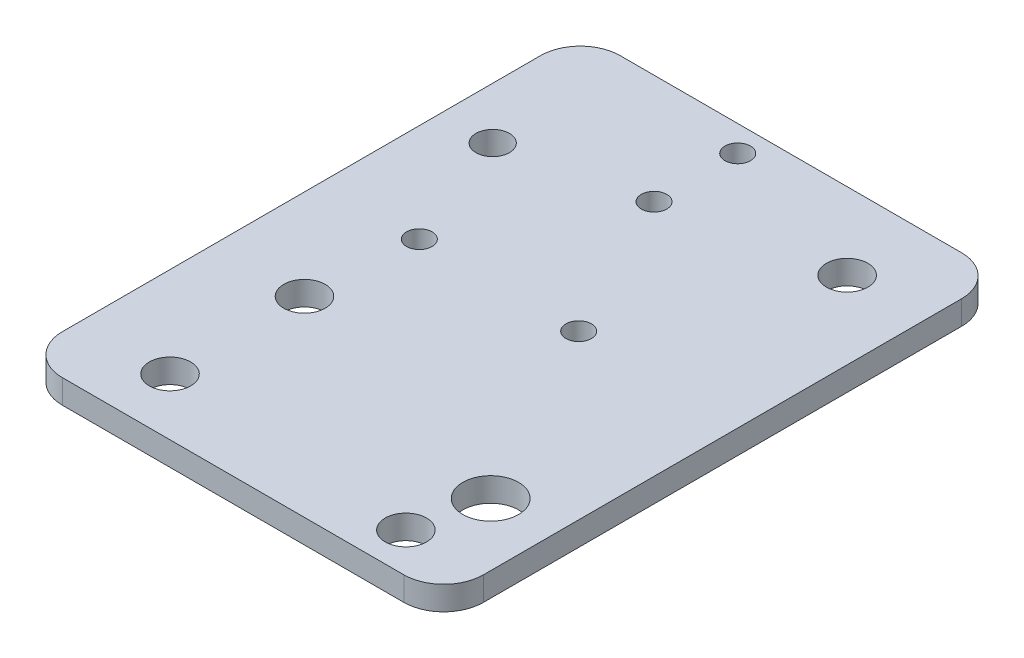
ISO-10303-21;
HEADER;
FILE_DESCRIPTION(('STEP AP214'),'2;1');
FILE_NAME('part.step','',(''),(''),'','','');
FILE_SCHEMA(('AUTOMOTIVE_DESIGN { 1 0 10303 214 1 1 1 1 }'));
ENDSEC;
DATA;
#1=APPLICATION_CONTEXT('core data for automotive mechanical design processes');
#2=APPLICATION_PROTOCOL_DEFINITION('international standard','automotive_design',2000,#1);
#3=PRODUCT_CONTEXT('',#1,'mechanical');
#4=PRODUCT('Part','Part','',(#3));
#5=PRODUCT_RELATED_PRODUCT_CATEGORY('part','',(#4));
#6=PRODUCT_DEFINITION_FORMATION('','',#4);
#7=PRODUCT_DEFINITION_CONTEXT('part definition',#1,'design');
#8=PRODUCT_DEFINITION('design','',#6,#7);
#9=PRODUCT_DEFINITION_SHAPE('','',#8);
#10=(LENGTH_UNIT() NAMED_UNIT(*) SI_UNIT(.MILLI.,.METRE.));
#11=(NAMED_UNIT(*) PLANE_ANGLE_UNIT() SI_UNIT($,.RADIAN.));
#12=(NAMED_UNIT(*) SI_UNIT($,.STERADIAN.) SOLID_ANGLE_UNIT());
#13=UNCERTAINTY_MEASURE_WITH_UNIT(LENGTH_MEASURE(1.E-05),#10,'distance_accuracy_value','');
#14=(GEOMETRIC_REPRESENTATION_CONTEXT(3) GLOBAL_UNCERTAINTY_ASSIGNED_CONTEXT((#13)) GLOBAL_UNIT_ASSIGNED_CONTEXT((#10,
#11,#12)) REPRESENTATION_CONTEXT('',''));
#15=CARTESIAN_POINT('',(0.,0.,0.));
#16=DIRECTION('',(0.,0.,1.));
#17=DIRECTION('',(1.,0.,0.));
#18=AXIS2_PLACEMENT_3D('',#15,#16,#17);
#19=CARTESIAN_POINT('',(0.,3.,0.));
#20=DIRECTION('',(0.,-1.,0.));
#21=DIRECTION('',(0.,0.,-1.));
#22=AXIS2_PLACEMENT_3D('',#19,#20,#21);
#23=PLANE('',#22);
#24=CARTESIAN_POINT('',(-55.1536510286206,3.,27.8419924035995));
#25=DIRECTION('',(0.,-1.,0.));
#26=DIRECTION('',(0.,0.,-1.));
#27=AXIS2_PLACEMENT_3D('',#24,#25,#26);
#28=CIRCLE('',#27,2.6);
#29=CARTESIAN_POINT('',(-55.1536510286206,3.,25.2419924035995));
#30=VERTEX_POINT('',#29);
#31=EDGE_CURVE('E217',#30,#30,#28,.T.);
#32=ORIENTED_EDGE('',*,*,#31,.T.);
#33=EDGE_LOOP('',(#32));
#34=FACE_BOUND('',#33,.T.);
#35=CARTESIAN_POINT('',(-34.1536511490396,3.,-2.44805253618551));
#36=DIRECTION('',(0.,-1.,0.));
#37=DIRECTION('',(0.,0.,-1.));
#38=AXIS2_PLACEMENT_3D('',#35,#36,#37);
#39=CIRCLE('',#38,1.6);
#40=CARTESIAN_POINT('',(-34.1536511490396,3.,-4.04805253618551));
#41=VERTEX_POINT('',#40);
#42=EDGE_CURVE('E206',#41,#41,#39,.T.);
#43=ORIENTED_EDGE('',*,*,#42,.T.);
#44=EDGE_LOOP('',(#43));
#45=FACE_BOUND('',#44,.T.);
#46=CARTESIAN_POINT('',(-55.1536510286206,3.,10.9673620704614));
#47=DIRECTION('',(0.,-1.,0.));
#48=DIRECTION('',(0.,0.,-1.));
#49=AXIS2_PLACEMENT_3D('',#46,#47,#48);
#50=CIRCLE('',#49,2.6);
#51=CARTESIAN_POINT('',(-55.1536510286206,3.,8.36736207046137));
#52=VERTEX_POINT('',#51);
#53=EDGE_CURVE('E205',#52,#52,#50,.T.);
#54=ORIENTED_EDGE('',*,*,#53,.T.);
#55=EDGE_LOOP('',(#54));
#56=FACE_BOUND('',#55,.T.);
#57=CARTESIAN_POINT('',(-23.3936511490355,3.,-25.3762360884705));
#58=DIRECTION('',(0.,-1.,0.));
#59=DIRECTION('',(0.,0.,-1.));
#60=AXIS2_PLACEMENT_3D('',#57,#58,#59);
#61=CIRCLE('',#60,2.6);
#62=CARTESIAN_POINT('',(-23.3936511490355,3.,-27.9762360884705));
#63=VERTEX_POINT('',#62);
#64=EDGE_CURVE('E199',#63,#63,#61,.T.);
#65=ORIENTED_EDGE('',*,*,#64,.T.);
#66=EDGE_LOOP('',(#65));
#67=FACE_BOUND('',#66,.T.);
#68=CARTESIAN_POINT('',(-54.1536511490395,3.,-2.44805253618551));
#69=DIRECTION('',(0.,-1.,0.));
#70=DIRECTION('',(0.,0.,-1.));
#71=AXIS2_PLACEMENT_3D('',#68,#69,#70);
#72=CIRCLE('',#71,1.6);
#73=CARTESIAN_POINT('',(-54.1536511490395,3.,-4.04805253618551));
#74=VERTEX_POINT('',#73);
#75=EDGE_CURVE('E218',#74,#74,#72,.T.);
#76=ORIENTED_EDGE('',*,*,#75,.T.);
#77=EDGE_LOOP('',(#76));
#78=FACE_BOUND('',#77,.T.);
#79=CARTESIAN_POINT('',(-23.3936511491627,3.,30.0000000000001));
#80=DIRECTION('',(0.,-1.,0.));
#81=DIRECTION('',(0.,0.,-1.));
#82=AXIS2_PLACEMENT_3D('',#79,#80,#81);
#83=CIRCLE('',#82,2.6);
#84=CARTESIAN_POINT('',(-23.3936511491627,3.,27.4000000000001));
#85=VERTEX_POINT('',#84);
#86=EDGE_CURVE('E194',#85,#85,#83,.T.);
#87=ORIENTED_EDGE('',*,*,#86,.T.);
#88=EDGE_LOOP('',(#87));
#89=FACE_BOUND('',#88,.T.);
#90=CARTESIAN_POINT('',(-43.5000000000002,3.,-21.25));
#91=DIRECTION('',(0.,-1.,0.));
#92=DIRECTION('',(0.,0.,1.));
#93=AXIS2_PLACEMENT_3D('',#90,#91,#92);
#94=CIRCLE('',#93,1.6);
#95=CARTESIAN_POINT('',(-43.5000000000002,3.,-19.65));
#96=VERTEX_POINT('',#95);
#97=EDGE_CURVE('E177',#96,#96,#94,.T.);
#98=ORIENTED_EDGE('',*,*,#97,.T.);
#99=EDGE_LOOP('',(#98));
#100=FACE_BOUND('',#99,.T.);
#101=CARTESIAN_POINT('',(-21.5000000000002,3.,21.25));
#102=DIRECTION('',(0.,-1.,0.));
#103=DIRECTION('',(0.,0.,-1.));
#104=AXIS2_PLACEMENT_3D('',#101,#102,#103);
#105=CIRCLE('',#104,3.5);
#106=CARTESIAN_POINT('',(-21.5000000000002,3.,17.75));
#107=VERTEX_POINT('',#106);
#108=EDGE_CURVE('E186',#107,#107,#105,.T.);
#109=ORIENTED_EDGE('',*,*,#108,.T.);
#110=EDGE_LOOP('',(#109));
#111=FACE_BOUND('',#110,.T.);
#112=CARTESIAN_POINT('',(-43.5000000000002,3.,-31.75));
#113=DIRECTION('',(0.,-1.,0.));
#114=DIRECTION('',(0.,0.,-1.));
#115=AXIS2_PLACEMENT_3D('',#112,#113,#114);
#116=CIRCLE('',#115,1.60000000000001);
#117=CARTESIAN_POINT('',(-43.5000000000002,3.,-33.35));
#118=VERTEX_POINT('',#117);
#119=EDGE_CURVE('E181',#118,#118,#116,.T.);
#120=ORIENTED_EDGE('',*,*,#119,.T.);
#121=EDGE_LOOP('',(#120));
#122=FACE_BOUND('',#121,.T.);
#123=CARTESIAN_POINT('',(-60.,3.,-17.5000000000001));
#124=DIRECTION('',(0.,1.,0.));
#125=DIRECTION('',(0.,0.,1.));
#126=AXIS2_PLACEMENT_3D('',#123,#124,#125);
#127=CIRCLE('',#126,2.1);
#128=CARTESIAN_POINT('',(-60.,3.,-15.4000000000001));
#129=VERTEX_POINT('',#128);
#130=EDGE_CURVE('E174',#129,#129,#127,.T.);
#131=ORIENTED_EDGE('',*,*,#130,.F.);
#132=EDGE_LOOP('',(#131));
#133=FACE_BOUND('',#132,.T.);
#134=DIRECTION('',(0.,0.,1.));
#135=VECTOR('',#134,1.);
#136=CARTESIAN_POINT('',(-13.6536511490428,3.,-35.));
#137=LINE('',#136,#135);
#138=CARTESIAN_POINT('',(-13.6536511490428,3.,-30.));
#139=VERTEX_POINT('',#138);
#140=CARTESIAN_POINT('',(-13.6536511490428,3.,30.));
#141=VERTEX_POINT('',#140);
#142=EDGE_CURVE('E164',#139,#141,#137,.T.);
#143=ORIENTED_EDGE('',*,*,#142,.F.);
#144=CARTESIAN_POINT('',(-18.6536511490428,3.,-30.));
#145=DIRECTION('',(0.,-1.,0.));
#146=DIRECTION('',(0.,0.,-1.));
#147=AXIS2_PLACEMENT_3D('',#144,#145,#146);
#148=CIRCLE('',#147,5.);
#149=CARTESIAN_POINT('',(-18.6536511490428,3.,-35.));
#150=VERTEX_POINT('',#149);
#151=EDGE_CURVE('E151',#139,#150,#148,.F.);
#152=ORIENTED_EDGE('',*,*,#151,.T.);
#153=DIRECTION('',(-1.,0.,0.));
#154=VECTOR('',#153,1.);
#155=CARTESIAN_POINT('',(-17.5,3.,-35.));
#156=LINE('',#155,#154);
#157=CARTESIAN_POINT('',(-61.5,3.,-35.));
#158=VERTEX_POINT('',#157);
#159=EDGE_CURVE('E129',#150,#158,#156,.T.);
#160=ORIENTED_EDGE('',*,*,#159,.T.);
#161=CARTESIAN_POINT('',(-61.5,3.,-30.));
#162=DIRECTION('',(0.,-1.,0.));
#163=DIRECTION('',(0.,0.,-1.));
#164=AXIS2_PLACEMENT_3D('',#161,#162,#163);
#165=CIRCLE('',#164,5.);
#166=CARTESIAN_POINT('',(-66.5,3.,-30.));
#167=VERTEX_POINT('',#166);
#168=EDGE_CURVE('E124',#158,#167,#165,.F.);
#169=ORIENTED_EDGE('',*,*,#168,.T.);
#170=DIRECTION('',(0.,0.,1.));
#171=VECTOR('',#170,1.);
#172=CARTESIAN_POINT('',(-66.5,3.,35.));
#173=LINE('',#172,#171);
#174=CARTESIAN_POINT('',(-66.5,3.,30.));
#175=VERTEX_POINT('',#174);
#176=EDGE_CURVE('E170',#167,#175,#173,.T.);
#177=ORIENTED_EDGE('',*,*,#176,.T.);
#178=CARTESIAN_POINT('',(-61.5,3.,30.));
#179=DIRECTION('',(0.,-1.,0.));
#180=DIRECTION('',(0.,0.,-1.));
#181=AXIS2_PLACEMENT_3D('',#178,#179,#180);
#182=CIRCLE('',#181,5.);
#183=CARTESIAN_POINT('',(-61.5,3.,35.));
#184=VERTEX_POINT('',#183);
#185=EDGE_CURVE('E119',#175,#184,#182,.F.);
#186=ORIENTED_EDGE('',*,*,#185,.T.);
#187=DIRECTION('',(1.,0.,0.));
#188=VECTOR('',#187,1.);
#189=CARTESIAN_POINT('',(-17.5,3.,35.));
#190=LINE('',#189,#188);
#191=CARTESIAN_POINT('',(-18.6536511490428,3.,35.));
#192=VERTEX_POINT('',#191);
#193=EDGE_CURVE('E125',#184,#192,#190,.T.);
#194=ORIENTED_EDGE('',*,*,#193,.T.);
#195=CARTESIAN_POINT('',(-18.6536511490428,3.,30.));
#196=DIRECTION('',(0.,-1.,0.));
#197=DIRECTION('',(0.,0.,-1.));
#198=AXIS2_PLACEMENT_3D('',#195,#196,#197);
#199=CIRCLE('',#198,5.);
#200=EDGE_CURVE('E149',#192,#141,#199,.F.);
#201=ORIENTED_EDGE('',*,*,#200,.T.);
#202=EDGE_LOOP('',(#143,#152,#160,#169,#177,#186,#194,#201));
#203=FACE_BOUND('',#202,.T.);
#204=ADVANCED_FACE('F36',(#34,#45,#56,#67,#78,#89,#100,#111,#122,#133,#203),#23,.F.);
#205=CARTESIAN_POINT('',(0.,0.,0.));
#206=DIRECTION('',(0.,-1.,0.));
#207=DIRECTION('',(0.,0.,-1.));
#208=AXIS2_PLACEMENT_3D('',#205,#206,#207);
#209=PLANE('',#208);
#210=CARTESIAN_POINT('',(-55.1536510286206,0.,27.8419924035995));
#211=DIRECTION('',(0.,-1.,0.));
#212=DIRECTION('',(0.,0.,-1.));
#213=AXIS2_PLACEMENT_3D('',#210,#211,#212);
#214=CIRCLE('',#213,2.6);
#215=CARTESIAN_POINT('',(-55.1536510286206,0.,25.2419924035995));
#216=VERTEX_POINT('',#215);
#217=EDGE_CURVE('E214',#216,#216,#214,.T.);
#218=ORIENTED_EDGE('',*,*,#217,.F.);
#219=EDGE_LOOP('',(#218));
#220=FACE_BOUND('',#219,.T.);
#221=CARTESIAN_POINT('',(-34.1536511490396,0.,-2.44805253618551));
#222=DIRECTION('',(0.,-1.,0.));
#223=DIRECTION('',(0.,0.,-1.));
#224=AXIS2_PLACEMENT_3D('',#221,#222,#223);
#225=CIRCLE('',#224,1.6);
#226=CARTESIAN_POINT('',(-34.1536511490396,0.,-4.04805253618551));
#227=VERTEX_POINT('',#226);
#228=EDGE_CURVE('E221',#227,#227,#225,.T.);
#229=ORIENTED_EDGE('',*,*,#228,.F.);
#230=EDGE_LOOP('',(#229));
#231=FACE_BOUND('',#230,.T.);
#232=CARTESIAN_POINT('',(-55.1536510286206,0.,10.9673620704614));
#233=DIRECTION('',(0.,-1.,0.));
#234=DIRECTION('',(0.,0.,-1.));
#235=AXIS2_PLACEMENT_3D('',#232,#233,#234);
#236=CIRCLE('',#235,2.6);
#237=CARTESIAN_POINT('',(-55.1536510286206,0.,8.36736207046137));
#238=VERTEX_POINT('',#237);
#239=EDGE_CURVE('E202',#238,#238,#236,.T.);
#240=ORIENTED_EDGE('',*,*,#239,.F.);
#241=EDGE_LOOP('',(#240));
#242=FACE_BOUND('',#241,.T.);
#243=CARTESIAN_POINT('',(-23.3936511490355,0.,-25.3762360884705));
#244=DIRECTION('',(0.,-1.,0.));
#245=DIRECTION('',(0.,0.,-1.));
#246=AXIS2_PLACEMENT_3D('',#243,#244,#245);
#247=CIRCLE('',#246,2.6);
#248=CARTESIAN_POINT('',(-23.3936511490355,0.,-27.9762360884705));
#249=VERTEX_POINT('',#248);
#250=EDGE_CURVE('E209',#249,#249,#247,.T.);
#251=ORIENTED_EDGE('',*,*,#250,.F.);
#252=EDGE_LOOP('',(#251));
#253=FACE_BOUND('',#252,.T.);
#254=CARTESIAN_POINT('',(-54.1536511490395,0.,-2.44805253618551));
#255=DIRECTION('',(0.,-1.,0.));
#256=DIRECTION('',(0.,0.,-1.));
#257=AXIS2_PLACEMENT_3D('',#254,#255,#256);
#258=CIRCLE('',#257,1.6);
#259=CARTESIAN_POINT('',(-54.1536511490395,0.,-4.04805253618551));
#260=VERTEX_POINT('',#259);
#261=EDGE_CURVE('E226',#260,#260,#258,.T.);
#262=ORIENTED_EDGE('',*,*,#261,.F.);
#263=EDGE_LOOP('',(#262));
#264=FACE_BOUND('',#263,.T.);
#265=CARTESIAN_POINT('',(-23.3936511491627,0.,30.0000000000001));
#266=DIRECTION('',(0.,-1.,0.));
#267=DIRECTION('',(0.,0.,-1.));
#268=AXIS2_PLACEMENT_3D('',#265,#266,#267);
#269=CIRCLE('',#268,2.6);
#270=CARTESIAN_POINT('',(-23.3936511491627,0.,27.4000000000001));
#271=VERTEX_POINT('',#270);
#272=EDGE_CURVE('E196',#271,#271,#269,.T.);
#273=ORIENTED_EDGE('',*,*,#272,.F.);
#274=EDGE_LOOP('',(#273));
#275=FACE_BOUND('',#274,.T.);
#276=DIRECTION('',(-1.,0.,0.));
#277=VECTOR('',#276,1.);
#278=CARTESIAN_POINT('',(-17.5,0.,-35.));
#279=LINE('',#278,#277);
#280=CARTESIAN_POINT('',(-18.6536511490428,0.,-35.));
#281=VERTEX_POINT('',#280);
#282=CARTESIAN_POINT('',(-61.5,0.,-35.));
#283=VERTEX_POINT('',#282);
#284=EDGE_CURVE('E102',#281,#283,#279,.T.);
#285=ORIENTED_EDGE('',*,*,#284,.F.);
#286=CARTESIAN_POINT('',(-18.6536511490428,0.,-30.));
#287=DIRECTION('',(0.,-1.,0.));
#288=DIRECTION('',(0.,0.,-1.));
#289=AXIS2_PLACEMENT_3D('',#286,#287,#288);
#290=CIRCLE('',#289,5.);
#291=CARTESIAN_POINT('',(-13.6536511490428,0.,-30.));
#292=VERTEX_POINT('',#291);
#293=EDGE_CURVE('E44',#281,#292,#290,.T.);
#294=ORIENTED_EDGE('',*,*,#293,.T.);
#295=DIRECTION('',(0.,0.,1.));
#296=VECTOR('',#295,1.);
#297=CARTESIAN_POINT('',(-13.6536511490428,0.,-35.));
#298=LINE('',#297,#296);
#299=CARTESIAN_POINT('',(-13.6536511490428,0.,30.));
#300=VERTEX_POINT('',#299);
#301=EDGE_CURVE('E155',#292,#300,#298,.T.);
#302=ORIENTED_EDGE('',*,*,#301,.T.);
#303=CARTESIAN_POINT('',(-18.6536511490428,0.,30.));
#304=DIRECTION('',(0.,-1.,0.));
#305=DIRECTION('',(0.,0.,-1.));
#306=AXIS2_PLACEMENT_3D('',#303,#304,#305);
#307=CIRCLE('',#306,5.);
#308=CARTESIAN_POINT('',(-18.6536511490428,0.,35.));
#309=VERTEX_POINT('',#308);
#310=EDGE_CURVE('E51',#300,#309,#307,.T.);
#311=ORIENTED_EDGE('',*,*,#310,.T.);
#312=DIRECTION('',(1.,0.,0.));
#313=VECTOR('',#312,1.);
#314=CARTESIAN_POINT('',(-17.5,0.,35.));
#315=LINE('',#314,#313);
#316=CARTESIAN_POINT('',(-61.5,0.,35.));
#317=VERTEX_POINT('',#316);
#318=EDGE_CURVE('E108',#317,#309,#315,.T.);
#319=ORIENTED_EDGE('',*,*,#318,.F.);
#320=CARTESIAN_POINT('',(-61.5,0.,30.));
#321=DIRECTION('',(0.,-1.,0.));
#322=DIRECTION('',(0.,0.,-1.));
#323=AXIS2_PLACEMENT_3D('',#320,#321,#322);
#324=CIRCLE('',#323,5.);
#325=CARTESIAN_POINT('',(-66.5,0.,30.));
#326=VERTEX_POINT('',#325);
#327=EDGE_CURVE('E120',#317,#326,#324,.T.);
#328=ORIENTED_EDGE('',*,*,#327,.T.);
#329=DIRECTION('',(0.,0.,1.));
#330=VECTOR('',#329,1.);
#331=CARTESIAN_POINT('',(-66.5,0.,35.));
#332=LINE('',#331,#330);
#333=CARTESIAN_POINT('',(-66.5,0.,-30.));
#334=VERTEX_POINT('',#333);
#335=EDGE_CURVE('E109',#334,#326,#332,.T.);
#336=ORIENTED_EDGE('',*,*,#335,.F.);
#337=CARTESIAN_POINT('',(-61.5,0.,-30.));
#338=DIRECTION('',(0.,-1.,0.));
#339=DIRECTION('',(0.,0.,-1.));
#340=AXIS2_PLACEMENT_3D('',#337,#338,#339);
#341=CIRCLE('',#340,5.);
#342=EDGE_CURVE('E113',#334,#283,#341,.T.);
#343=ORIENTED_EDGE('',*,*,#342,.T.);
#344=EDGE_LOOP('',(#285,#294,#302,#311,#319,#328,#336,#343));
#345=FACE_BOUND('',#344,.T.);
#346=CARTESIAN_POINT('',(-43.5000000000002,0.,-21.25));
#347=DIRECTION('',(0.,-1.,0.));
#348=DIRECTION('',(0.,0.,1.));
#349=AXIS2_PLACEMENT_3D('',#346,#347,#348);
#350=CIRCLE('',#349,1.6);
#351=CARTESIAN_POINT('',(-43.5000000000002,0.,-19.65));
#352=VERTEX_POINT('',#351);
#353=EDGE_CURVE('E178',#352,#352,#350,.T.);
#354=ORIENTED_EDGE('',*,*,#353,.F.);
#355=EDGE_LOOP('',(#354));
#356=FACE_BOUND('',#355,.T.);
#357=CARTESIAN_POINT('',(-21.5000000000002,0.,21.25));
#358=DIRECTION('',(0.,-1.,0.));
#359=DIRECTION('',(0.,0.,-1.));
#360=AXIS2_PLACEMENT_3D('',#357,#358,#359);
#361=CIRCLE('',#360,3.5);
#362=CARTESIAN_POINT('',(-21.5000000000002,0.,17.75));
#363=VERTEX_POINT('',#362);
#364=EDGE_CURVE('E163',#363,#363,#361,.T.);
#365=ORIENTED_EDGE('',*,*,#364,.F.);
#366=EDGE_LOOP('',(#365));
#367=FACE_BOUND('',#366,.T.);
#368=CARTESIAN_POINT('',(-43.5000000000002,0.,-31.75));
#369=DIRECTION('',(0.,-1.,0.));
#370=DIRECTION('',(0.,0.,-1.));
#371=AXIS2_PLACEMENT_3D('',#368,#369,#370);
#372=CIRCLE('',#371,1.60000000000001);
#373=CARTESIAN_POINT('',(-43.5000000000002,0.,-33.35));
#374=VERTEX_POINT('',#373);
#375=EDGE_CURVE('E189',#374,#374,#372,.T.);
#376=ORIENTED_EDGE('',*,*,#375,.F.);
#377=EDGE_LOOP('',(#376));
#378=FACE_BOUND('',#377,.T.);
#379=CARTESIAN_POINT('',(-60.,0.,-17.5000000000001));
#380=DIRECTION('',(0.,-1.,0.));
#381=DIRECTION('',(0.,0.,-1.));
#382=AXIS2_PLACEMENT_3D('',#379,#380,#381);
#383=CIRCLE('',#382,2.1);
#384=CARTESIAN_POINT('',(-60.,0.,-19.6000000000001));
#385=VERTEX_POINT('',#384);
#386=EDGE_CURVE('E132',#385,#385,#383,.T.);
#387=ORIENTED_EDGE('',*,*,#386,.F.);
#388=EDGE_LOOP('',(#387));
#389=FACE_BOUND('',#388,.T.);
#390=ADVANCED_FACE('F114',(#220,#231,#242,#253,#264,#275,#345,#356,#367,#378,#389),#209,.T.);
#391=CARTESIAN_POINT('',(-17.5,3.,-35.));
#392=DIRECTION('',(0.,0.,1.));
#393=DIRECTION('',(1.,0.,0.));
#394=AXIS2_PLACEMENT_3D('',#391,#392,#393);
#395=PLANE('',#394);
#396=ORIENTED_EDGE('',*,*,#159,.F.);
#397=DIRECTION('',(0.,1.,0.));
#398=VECTOR('',#397,1.);
#399=CARTESIAN_POINT('',(-18.6536511490428,3.,-35.));
#400=LINE('',#399,#398);
#401=EDGE_CURVE('E59',#150,#281,#400,.F.);
#402=ORIENTED_EDGE('',*,*,#401,.T.);
#403=ORIENTED_EDGE('',*,*,#284,.T.);
#404=DIRECTION('',(0.,1.,0.));
#405=VECTOR('',#404,1.);
#406=CARTESIAN_POINT('',(-61.5,3.,-35.));
#407=LINE('',#406,#405);
#408=EDGE_CURVE('E106',#283,#158,#407,.T.);
#409=ORIENTED_EDGE('',*,*,#408,.T.);
#410=EDGE_LOOP('',(#396,#402,#403,#409));
#411=FACE_BOUND('',#410,.T.);
#412=ADVANCED_FACE('F104',(#411),#395,.F.);
#413=CARTESIAN_POINT('',(-17.5,3.,35.));
#414=DIRECTION('',(0.,0.,-1.));
#415=DIRECTION('',(-1.,0.,0.));
#416=AXIS2_PLACEMENT_3D('',#413,#414,#415);
#417=PLANE('',#416);
#418=ORIENTED_EDGE('',*,*,#318,.T.);
#419=DIRECTION('',(0.,1.,0.));
#420=VECTOR('',#419,1.);
#421=CARTESIAN_POINT('',(-18.6536511490428,3.,35.));
#422=LINE('',#421,#420);
#423=EDGE_CURVE('E11',#309,#192,#422,.T.);
#424=ORIENTED_EDGE('',*,*,#423,.T.);
#425=ORIENTED_EDGE('',*,*,#193,.F.);
#426=DIRECTION('',(0.,1.,0.));
#427=VECTOR('',#426,1.);
#428=CARTESIAN_POINT('',(-61.5,0.,35.));
#429=LINE('',#428,#427);
#430=EDGE_CURVE('E142',#184,#317,#429,.F.);
#431=ORIENTED_EDGE('',*,*,#430,.T.);
#432=EDGE_LOOP('',(#418,#424,#425,#431));
#433=FACE_BOUND('',#432,.T.);
#434=ADVANCED_FACE('F268',(#433),#417,.F.);
#435=CARTESIAN_POINT('',(-66.5,0.,35.));
#436=DIRECTION('',(-1.,0.,0.));
#437=DIRECTION('',(0.,0.,1.));
#438=AXIS2_PLACEMENT_3D('',#435,#436,#437);
#439=PLANE('',#438);
#440=ORIENTED_EDGE('',*,*,#176,.F.);
#441=DIRECTION('',(0.,1.,0.));
#442=VECTOR('',#441,1.);
#443=CARTESIAN_POINT('',(-66.5,0.,-30.));
#444=LINE('',#443,#442);
#445=EDGE_CURVE('E140',#167,#334,#444,.F.);
#446=ORIENTED_EDGE('',*,*,#445,.T.);
#447=ORIENTED_EDGE('',*,*,#335,.T.);
#448=DIRECTION('',(0.,1.,0.));
#449=VECTOR('',#448,1.);
#450=CARTESIAN_POINT('',(-66.5,3.,30.));
#451=LINE('',#450,#449);
#452=EDGE_CURVE('E137',#326,#175,#451,.T.);
#453=ORIENTED_EDGE('',*,*,#452,.T.);
#454=EDGE_LOOP('',(#440,#446,#447,#453));
#455=FACE_BOUND('',#454,.T.);
#456=ADVANCED_FACE('F265',(#455),#439,.T.);
#457=CARTESIAN_POINT('',(-60.,-7.,-17.5000000000001));
#458=DIRECTION('',(0.,1.,0.));
#459=DIRECTION('',(0.,0.,1.));
#460=AXIS2_PLACEMENT_3D('',#457,#458,#459);
#461=CYLINDRICAL_SURFACE('',#460,2.1);
#462=ORIENTED_EDGE('',*,*,#386,.T.);
#463=EDGE_LOOP('',(#462));
#464=FACE_BOUND('',#463,.T.);
#465=ORIENTED_EDGE('',*,*,#130,.T.);
#466=EDGE_LOOP('',(#465));
#467=FACE_BOUND('',#466,.T.);
#468=ADVANCED_FACE('F291',(#464,#467),#461,.F.);
#469=CARTESIAN_POINT('',(-43.5000000000002,3.,-31.75));
#470=DIRECTION('',(0.,-1.,0.));
#471=DIRECTION('',(0.,0.,-1.));
#472=AXIS2_PLACEMENT_3D('',#469,#470,#471);
#473=CYLINDRICAL_SURFACE('',#472,1.60000000000001);
#474=ORIENTED_EDGE('',*,*,#119,.F.);
#475=EDGE_LOOP('',(#474));
#476=FACE_BOUND('',#475,.T.);
#477=ORIENTED_EDGE('',*,*,#375,.T.);
#478=EDGE_LOOP('',(#477));
#479=FACE_BOUND('',#478,.T.);
#480=ADVANCED_FACE('F287',(#476,#479),#473,.F.);
#481=CARTESIAN_POINT('',(-21.5000000000002,3.,21.25));
#482=DIRECTION('',(0.,-1.,0.));
#483=DIRECTION('',(0.,0.,-1.));
#484=AXIS2_PLACEMENT_3D('',#481,#482,#483);
#485=CYLINDRICAL_SURFACE('',#484,3.5);
#486=ORIENTED_EDGE('',*,*,#108,.F.);
#487=EDGE_LOOP('',(#486));
#488=FACE_BOUND('',#487,.T.);
#489=ORIENTED_EDGE('',*,*,#364,.T.);
#490=EDGE_LOOP('',(#489));
#491=FACE_BOUND('',#490,.T.);
#492=ADVANCED_FACE('F290',(#488,#491),#485,.F.);
#493=CARTESIAN_POINT('',(-43.5000000000002,3.,-21.25));
#494=DIRECTION('',(0.,-1.,0.));
#495=DIRECTION('',(0.,0.,-1.));
#496=AXIS2_PLACEMENT_3D('',#493,#494,#495);
#497=CYLINDRICAL_SURFACE('',#496,1.6);
#498=ORIENTED_EDGE('',*,*,#97,.F.);
#499=EDGE_LOOP('',(#498));
#500=FACE_BOUND('',#499,.T.);
#501=ORIENTED_EDGE('',*,*,#353,.T.);
#502=EDGE_LOOP('',(#501));
#503=FACE_BOUND('',#502,.T.);
#504=ADVANCED_FACE('F277',(#500,#503),#497,.F.);
#505=CARTESIAN_POINT('',(-61.5,3.,-30.));
#506=DIRECTION('',(0.,-1.,0.));
#507=DIRECTION('',(0.,0.,-1.));
#508=AXIS2_PLACEMENT_3D('',#505,#506,#507);
#509=CYLINDRICAL_SURFACE('',#508,5.);
#510=ORIENTED_EDGE('',*,*,#342,.F.);
#511=ORIENTED_EDGE('',*,*,#445,.F.);
#512=ORIENTED_EDGE('',*,*,#168,.F.);
#513=ORIENTED_EDGE('',*,*,#408,.F.);
#514=EDGE_LOOP('',(#510,#511,#512,#513));
#515=FACE_BOUND('',#514,.T.);
#516=ADVANCED_FACE('F123',(#515),#509,.T.);
#517=CARTESIAN_POINT('',(-61.5,0.,30.));
#518=DIRECTION('',(0.,-1.,0.));
#519=DIRECTION('',(0.,0.,-1.));
#520=AXIS2_PLACEMENT_3D('',#517,#518,#519);
#521=CYLINDRICAL_SURFACE('',#520,5.);
#522=ORIENTED_EDGE('',*,*,#327,.F.);
#523=ORIENTED_EDGE('',*,*,#430,.F.);
#524=ORIENTED_EDGE('',*,*,#185,.F.);
#525=ORIENTED_EDGE('',*,*,#452,.F.);
#526=EDGE_LOOP('',(#522,#523,#524,#525));
#527=FACE_BOUND('',#526,.T.);
#528=ADVANCED_FACE('F276',(#527),#521,.T.);
#529=CARTESIAN_POINT('',(-13.6536511490428,0.,-35.));
#530=DIRECTION('',(-1.,0.,0.));
#531=DIRECTION('',(0.,0.,1.));
#532=AXIS2_PLACEMENT_3D('',#529,#530,#531);
#533=PLANE('',#532);
#534=ORIENTED_EDGE('',*,*,#301,.F.);
#535=DIRECTION('',(0.,1.,0.));
#536=VECTOR('',#535,1.);
#537=CARTESIAN_POINT('',(-13.6536511490428,0.,-30.));
#538=LINE('',#537,#536);
#539=EDGE_CURVE('E146',#292,#139,#538,.T.);
#540=ORIENTED_EDGE('',*,*,#539,.T.);
#541=ORIENTED_EDGE('',*,*,#142,.T.);
#542=DIRECTION('',(0.,1.,0.));
#543=VECTOR('',#542,1.);
#544=CARTESIAN_POINT('',(-13.6536511490428,0.,30.));
#545=LINE('',#544,#543);
#546=EDGE_CURVE('E144',#141,#300,#545,.F.);
#547=ORIENTED_EDGE('',*,*,#546,.T.);
#548=EDGE_LOOP('',(#534,#540,#541,#547));
#549=FACE_BOUND('',#548,.T.);
#550=ADVANCED_FACE('F159',(#549),#533,.F.);
#551=CARTESIAN_POINT('',(-18.6536511490428,0.,-30.));
#552=DIRECTION('',(0.,1.,0.));
#553=DIRECTION('',(0.,0.,1.));
#554=AXIS2_PLACEMENT_3D('',#551,#552,#553);
#555=CYLINDRICAL_SURFACE('',#554,5.);
#556=ORIENTED_EDGE('',*,*,#293,.F.);
#557=ORIENTED_EDGE('',*,*,#401,.F.);
#558=ORIENTED_EDGE('',*,*,#151,.F.);
#559=ORIENTED_EDGE('',*,*,#539,.F.);
#560=EDGE_LOOP('',(#556,#557,#558,#559));
#561=FACE_BOUND('',#560,.T.);
#562=ADVANCED_FACE('F166',(#561),#555,.T.);
#563=CARTESIAN_POINT('',(-18.6536511490428,3.,30.));
#564=DIRECTION('',(0.,1.,0.));
#565=DIRECTION('',(0.,0.,1.));
#566=AXIS2_PLACEMENT_3D('',#563,#564,#565);
#567=CYLINDRICAL_SURFACE('',#566,5.);
#568=ORIENTED_EDGE('',*,*,#310,.F.);
#569=ORIENTED_EDGE('',*,*,#546,.F.);
#570=ORIENTED_EDGE('',*,*,#200,.F.);
#571=ORIENTED_EDGE('',*,*,#423,.F.);
#572=EDGE_LOOP('',(#568,#569,#570,#571));
#573=FACE_BOUND('',#572,.T.);
#574=ADVANCED_FACE('F38',(#573),#567,.T.);
#575=CARTESIAN_POINT('',(-23.3936511491627,3.,30.0000000000001));
#576=DIRECTION('',(0.,-1.,0.));
#577=DIRECTION('',(0.,0.,-1.));
#578=AXIS2_PLACEMENT_3D('',#575,#576,#577);
#579=CYLINDRICAL_SURFACE('',#578,2.6);
#580=ORIENTED_EDGE('',*,*,#86,.F.);
#581=EDGE_LOOP('',(#580));
#582=FACE_BOUND('',#581,.T.);
#583=ORIENTED_EDGE('',*,*,#272,.T.);
#584=EDGE_LOOP('',(#583));
#585=FACE_BOUND('',#584,.T.);
#586=ADVANCED_FACE('F238',(#582,#585),#579,.F.);
#587=CARTESIAN_POINT('',(-54.1536511490395,3.,-2.44805253618551));
#588=DIRECTION('',(0.,-1.,0.));
#589=DIRECTION('',(0.,0.,-1.));
#590=AXIS2_PLACEMENT_3D('',#587,#588,#589);
#591=CYLINDRICAL_SURFACE('',#590,1.6);
#592=ORIENTED_EDGE('',*,*,#75,.F.);
#593=EDGE_LOOP('',(#592));
#594=FACE_BOUND('',#593,.T.);
#595=ORIENTED_EDGE('',*,*,#261,.T.);
#596=EDGE_LOOP('',(#595));
#597=FACE_BOUND('',#596,.T.);
#598=ADVANCED_FACE('F234',(#594,#597),#591,.F.);
#599=CARTESIAN_POINT('',(-23.3936511490355,3.,-25.3762360884705));
#600=DIRECTION('',(0.,-1.,0.));
#601=DIRECTION('',(0.,0.,-1.));
#602=AXIS2_PLACEMENT_3D('',#599,#600,#601);
#603=CYLINDRICAL_SURFACE('',#602,2.6);
#604=ORIENTED_EDGE('',*,*,#64,.F.);
#605=EDGE_LOOP('',(#604));
#606=FACE_BOUND('',#605,.T.);
#607=ORIENTED_EDGE('',*,*,#250,.T.);
#608=EDGE_LOOP('',(#607));
#609=FACE_BOUND('',#608,.T.);
#610=ADVANCED_FACE('F237',(#606,#609),#603,.F.);
#611=CARTESIAN_POINT('',(-55.1536510286206,3.,10.9673620704614));
#612=DIRECTION('',(0.,-1.,0.));
#613=DIRECTION('',(0.,0.,-1.));
#614=AXIS2_PLACEMENT_3D('',#611,#612,#613);
#615=CYLINDRICAL_SURFACE('',#614,2.6);
#616=ORIENTED_EDGE('',*,*,#53,.F.);
#617=EDGE_LOOP('',(#616));
#618=FACE_BOUND('',#617,.T.);
#619=ORIENTED_EDGE('',*,*,#239,.T.);
#620=EDGE_LOOP('',(#619));
#621=FACE_BOUND('',#620,.T.);
#622=ADVANCED_FACE('F356',(#618,#621),#615,.F.);
#623=CARTESIAN_POINT('',(-34.1536511490396,3.,-2.44805253618551));
#624=DIRECTION('',(0.,-1.,0.));
#625=DIRECTION('',(0.,0.,-1.));
#626=AXIS2_PLACEMENT_3D('',#623,#624,#625);
#627=CYLINDRICAL_SURFACE('',#626,1.6);
#628=ORIENTED_EDGE('',*,*,#42,.F.);
#629=EDGE_LOOP('',(#628));
#630=FACE_BOUND('',#629,.T.);
#631=ORIENTED_EDGE('',*,*,#228,.T.);
#632=EDGE_LOOP('',(#631));
#633=FACE_BOUND('',#632,.T.);
#634=ADVANCED_FACE('F366',(#630,#633),#627,.F.);
#635=CARTESIAN_POINT('',(-55.1536510286206,3.,27.8419924035995));
#636=DIRECTION('',(0.,-1.,0.));
#637=DIRECTION('',(0.,0.,-1.));
#638=AXIS2_PLACEMENT_3D('',#635,#636,#637);
#639=CYLINDRICAL_SURFACE('',#638,2.6);
#640=ORIENTED_EDGE('',*,*,#31,.F.);
#641=EDGE_LOOP('',(#640));
#642=FACE_BOUND('',#641,.T.);
#643=ORIENTED_EDGE('',*,*,#217,.T.);
#644=EDGE_LOOP('',(#643));
#645=FACE_BOUND('',#644,.T.);
#646=ADVANCED_FACE('F375',(#642,#645),#639,.F.);
#647=CLOSED_SHELL('',(#204,#390,#412,#434,#456,#468,#480,#492,#504,#516,#528,#550,#562,#574,
#586,#598,#610,#622,#634,#646));
#648=MANIFOLD_SOLID_BREP('B2',#647);
#649=ADVANCED_BREP_SHAPE_REPRESENTATION('',(#18,#648),#14);
#650=SHAPE_DEFINITION_REPRESENTATION(#9,#649);
ENDSEC;
END-ISO-10303-21;
